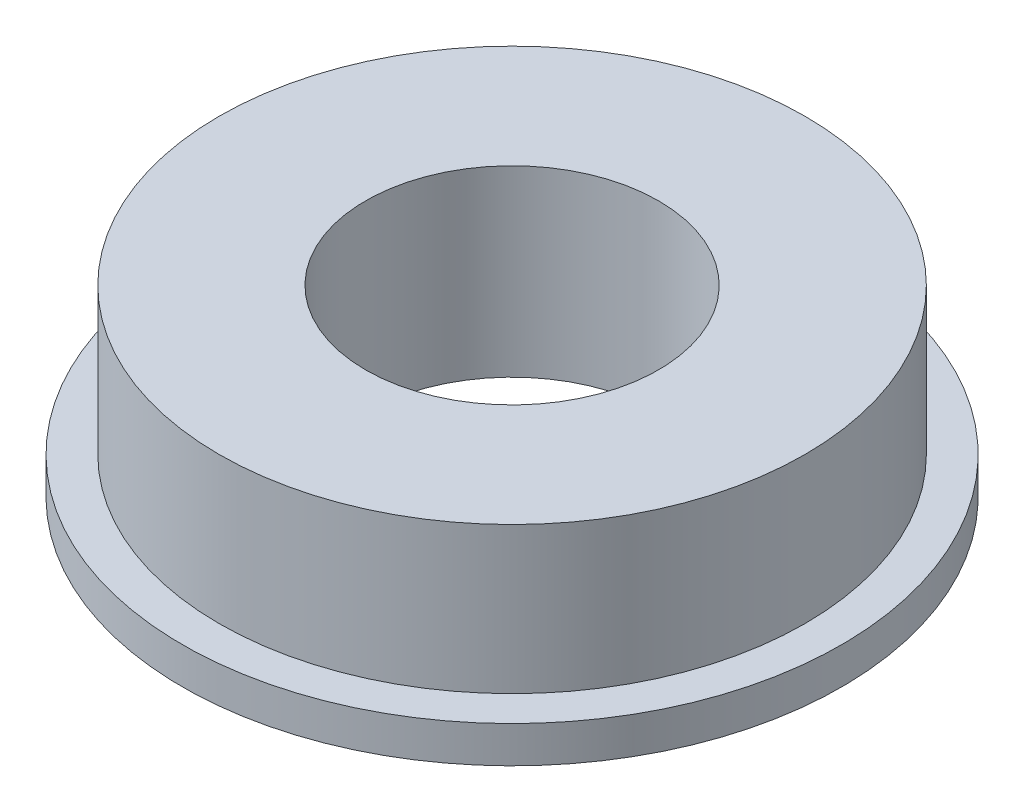
ISO-10303-21;
HEADER;
FILE_DESCRIPTION(('STEP AP214'),'2;1');
FILE_NAME('part.step','',(''),(''),'','','');
FILE_SCHEMA(('AUTOMOTIVE_DESIGN { 1 0 10303 214 1 1 1 1 }'));
ENDSEC;
DATA;
#1=APPLICATION_CONTEXT('core data for automotive mechanical design processes');
#2=APPLICATION_PROTOCOL_DEFINITION('international standard','automotive_design',2000,#1);
#3=PRODUCT_CONTEXT('',#1,'mechanical');
#4=PRODUCT('Part','Part','',(#3));
#5=PRODUCT_RELATED_PRODUCT_CATEGORY('part','',(#4));
#6=PRODUCT_DEFINITION_FORMATION('','',#4);
#7=PRODUCT_DEFINITION_CONTEXT('part definition',#1,'design');
#8=PRODUCT_DEFINITION('design','',#6,#7);
#9=PRODUCT_DEFINITION_SHAPE('','',#8);
#10=(LENGTH_UNIT() NAMED_UNIT(*) SI_UNIT(.MILLI.,.METRE.));
#11=(NAMED_UNIT(*) PLANE_ANGLE_UNIT() SI_UNIT($,.RADIAN.));
#12=(NAMED_UNIT(*) SI_UNIT($,.STERADIAN.) SOLID_ANGLE_UNIT());
#13=UNCERTAINTY_MEASURE_WITH_UNIT(LENGTH_MEASURE(1.E-05),#10,'distance_accuracy_value','');
#14=(GEOMETRIC_REPRESENTATION_CONTEXT(3) GLOBAL_UNCERTAINTY_ASSIGNED_CONTEXT((#13)) GLOBAL_UNIT_ASSIGNED_CONTEXT((#10,
#11,#12)) REPRESENTATION_CONTEXT('',''));
#15=CARTESIAN_POINT('',(0.,0.,0.));
#16=DIRECTION('',(0.,0.,1.));
#17=DIRECTION('',(1.,0.,0.));
#18=AXIS2_PLACEMENT_3D('',#15,#16,#17);
#19=CARTESIAN_POINT('',(0.,-2.5,0.));
#20=DIRECTION('',(0.,-1.,0.));
#21=DIRECTION('',(0.,0.,-1.));
#22=AXIS2_PLACEMENT_3D('',#19,#20,#21);
#23=CYLINDRICAL_SURFACE('',#22,9.);
#24=CARTESIAN_POINT('',(0.,-2.5,0.));
#25=DIRECTION('',(0.,-1.,0.));
#26=DIRECTION('',(0.,0.,-1.));
#27=AXIS2_PLACEMENT_3D('',#24,#25,#26);
#28=CIRCLE('',#27,9.);
#29=CARTESIAN_POINT('',(0.,-2.5,-9.));
#30=VERTEX_POINT('',#29);
#31=EDGE_CURVE('E10',#30,#30,#28,.T.);
#32=ORIENTED_EDGE('',*,*,#31,.F.);
#33=EDGE_LOOP('',(#32));
#34=FACE_BOUND('',#33,.T.);
#35=CARTESIAN_POINT('',(0.,-1.5,0.));
#36=DIRECTION('',(0.,-1.,0.));
#37=DIRECTION('',(0.,0.,-1.));
#38=AXIS2_PLACEMENT_3D('',#35,#36,#37);
#39=CIRCLE('',#38,9.);
#40=CARTESIAN_POINT('',(0.,-1.5,-9.));
#41=VERTEX_POINT('',#40);
#42=EDGE_CURVE('E66',#41,#41,#39,.T.);
#43=ORIENTED_EDGE('',*,*,#42,.T.);
#44=EDGE_LOOP('',(#43));
#45=FACE_BOUND('',#44,.T.);
#46=ADVANCED_FACE('F39',(#34,#45),#23,.T.);
#47=CARTESIAN_POINT('',(0.,-2.5,0.));
#48=DIRECTION('',(0.,1.,0.));
#49=DIRECTION('',(0.,0.,1.));
#50=AXIS2_PLACEMENT_3D('',#47,#48,#49);
#51=PLANE('',#50);
#52=CARTESIAN_POINT('',(0.,-2.5,0.));
#53=DIRECTION('',(0.,-1.,0.));
#54=DIRECTION('',(0.,0.,-1.));
#55=AXIS2_PLACEMENT_3D('',#52,#53,#54);
#56=CIRCLE('',#55,4.);
#57=CARTESIAN_POINT('',(0.,-2.5,-4.));
#58=VERTEX_POINT('',#57);
#59=EDGE_CURVE('E46',#58,#58,#56,.T.);
#60=ORIENTED_EDGE('',*,*,#59,.F.);
#61=EDGE_LOOP('',(#60));
#62=FACE_BOUND('',#61,.T.);
#63=ORIENTED_EDGE('',*,*,#31,.T.);
#64=EDGE_LOOP('',(#63));
#65=FACE_BOUND('',#64,.T.);
#66=ADVANCED_FACE('F92',(#62,#65),#51,.F.);
#67=CARTESIAN_POINT('',(0.,-2.5,0.));
#68=DIRECTION('',(0.,-1.,0.));
#69=DIRECTION('',(0.,0.,-1.));
#70=AXIS2_PLACEMENT_3D('',#67,#68,#69);
#71=CYLINDRICAL_SURFACE('',#70,4.);
#72=CARTESIAN_POINT('',(0.,2.5,0.));
#73=DIRECTION('',(0.,-1.,0.));
#74=DIRECTION('',(0.,0.,-1.));
#75=AXIS2_PLACEMENT_3D('',#72,#73,#74);
#76=CIRCLE('',#75,4.);
#77=CARTESIAN_POINT('',(0.,2.5,-4.));
#78=VERTEX_POINT('',#77);
#79=EDGE_CURVE('E51',#78,#78,#76,.T.);
#80=ORIENTED_EDGE('',*,*,#79,.F.);
#81=EDGE_LOOP('',(#80));
#82=FACE_BOUND('',#81,.T.);
#83=ORIENTED_EDGE('',*,*,#59,.T.);
#84=EDGE_LOOP('',(#83));
#85=FACE_BOUND('',#84,.T.);
#86=ADVANCED_FACE('F87',(#82,#85),#71,.F.);
#87=CARTESIAN_POINT('',(0.,2.5,0.));
#88=DIRECTION('',(0.,-1.,0.));
#89=DIRECTION('',(0.,0.,-1.));
#90=AXIS2_PLACEMENT_3D('',#87,#88,#89);
#91=PLANE('',#90);
#92=CARTESIAN_POINT('',(0.,2.5,0.));
#93=DIRECTION('',(0.,-1.,0.));
#94=DIRECTION('',(0.,0.,-1.));
#95=AXIS2_PLACEMENT_3D('',#92,#93,#94);
#96=CIRCLE('',#95,8.);
#97=CARTESIAN_POINT('',(0.,2.5,-8.));
#98=VERTEX_POINT('',#97);
#99=EDGE_CURVE('E56',#98,#98,#96,.T.);
#100=ORIENTED_EDGE('',*,*,#99,.F.);
#101=EDGE_LOOP('',(#100));
#102=FACE_BOUND('',#101,.T.);
#103=ORIENTED_EDGE('',*,*,#79,.T.);
#104=EDGE_LOOP('',(#103));
#105=FACE_BOUND('',#104,.T.);
#106=ADVANCED_FACE('F81',(#102,#105),#91,.F.);
#107=CARTESIAN_POINT('',(0.,-2.5,0.));
#108=DIRECTION('',(0.,-1.,0.));
#109=DIRECTION('',(0.,0.,-1.));
#110=AXIS2_PLACEMENT_3D('',#107,#108,#109);
#111=CYLINDRICAL_SURFACE('',#110,8.);
#112=CARTESIAN_POINT('',(0.,-1.5,0.));
#113=DIRECTION('',(0.,-1.,0.));
#114=DIRECTION('',(0.,0.,-1.));
#115=AXIS2_PLACEMENT_3D('',#112,#113,#114);
#116=CIRCLE('',#115,8.);
#117=CARTESIAN_POINT('',(0.,-1.5,-8.));
#118=VERTEX_POINT('',#117);
#119=EDGE_CURVE('E62',#118,#118,#116,.T.);
#120=ORIENTED_EDGE('',*,*,#119,.F.);
#121=EDGE_LOOP('',(#120));
#122=FACE_BOUND('',#121,.T.);
#123=ORIENTED_EDGE('',*,*,#99,.T.);
#124=EDGE_LOOP('',(#123));
#125=FACE_BOUND('',#124,.T.);
#126=ADVANCED_FACE('F75',(#122,#125),#111,.T.);
#127=CARTESIAN_POINT('',(0.,-1.5,0.));
#128=DIRECTION('',(0.,-1.,0.));
#129=DIRECTION('',(0.,0.,-1.));
#130=AXIS2_PLACEMENT_3D('',#127,#128,#129);
#131=PLANE('',#130);
#132=ORIENTED_EDGE('',*,*,#42,.F.);
#133=EDGE_LOOP('',(#132));
#134=FACE_BOUND('',#133,.T.);
#135=ORIENTED_EDGE('',*,*,#119,.T.);
#136=EDGE_LOOP('',(#135));
#137=FACE_BOUND('',#136,.T.);
#138=ADVANCED_FACE('F72',(#134,#137),#131,.F.);
#139=CLOSED_SHELL('',(#46,#66,#86,#106,#126,#138));
#140=MANIFOLD_SOLID_BREP('B2',#139);
#141=ADVANCED_BREP_SHAPE_REPRESENTATION('',(#18,#140),#14);
#142=SHAPE_DEFINITION_REPRESENTATION(#9,#141);
ENDSEC;
END-ISO-10303-21;
